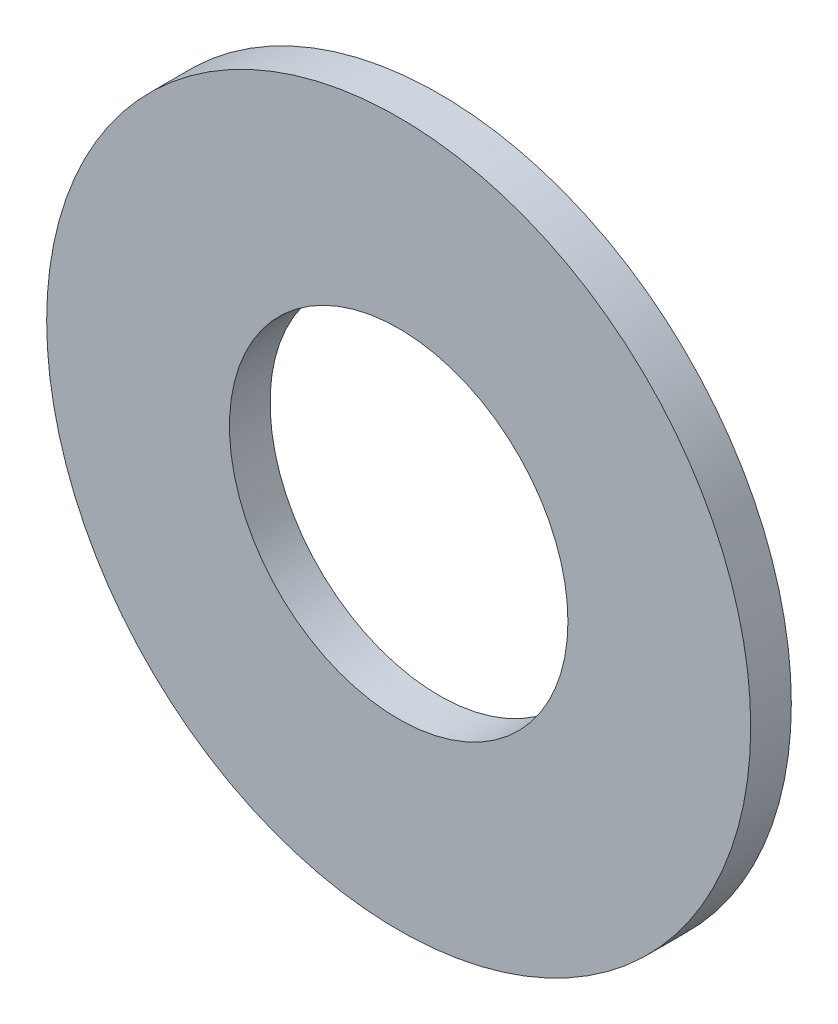
ISO-10303-21;
HEADER;
FILE_DESCRIPTION(('STEP AP214'),'2;1');
FILE_NAME('part.step','',(''),(''),'','','');
FILE_SCHEMA(('AUTOMOTIVE_DESIGN { 1 0 10303 214 1 1 1 1 }'));
ENDSEC;
DATA;
#1=APPLICATION_CONTEXT('core data for automotive mechanical design processes');
#2=APPLICATION_PROTOCOL_DEFINITION('international standard','automotive_design',2000,#1);
#3=PRODUCT_CONTEXT('',#1,'mechanical');
#4=PRODUCT('Part','Part','',(#3));
#5=PRODUCT_RELATED_PRODUCT_CATEGORY('part','',(#4));
#6=PRODUCT_DEFINITION_FORMATION('','',#4);
#7=PRODUCT_DEFINITION_CONTEXT('part definition',#1,'design');
#8=PRODUCT_DEFINITION('design','',#6,#7);
#9=PRODUCT_DEFINITION_SHAPE('','',#8);
#10=(LENGTH_UNIT() NAMED_UNIT(*) SI_UNIT(.MILLI.,.METRE.));
#11=(NAMED_UNIT(*) PLANE_ANGLE_UNIT() SI_UNIT($,.RADIAN.));
#12=(NAMED_UNIT(*) SI_UNIT($,.STERADIAN.) SOLID_ANGLE_UNIT());
#13=UNCERTAINTY_MEASURE_WITH_UNIT(LENGTH_MEASURE(1.E-05),#10,'distance_accuracy_value','');
#14=(GEOMETRIC_REPRESENTATION_CONTEXT(3) GLOBAL_UNCERTAINTY_ASSIGNED_CONTEXT((#13)) GLOBAL_UNIT_ASSIGNED_CONTEXT((#10,
#11,#12)) REPRESENTATION_CONTEXT('',''));
#15=CARTESIAN_POINT('',(0.,0.,0.));
#16=DIRECTION('',(0.,0.,1.));
#17=DIRECTION('',(1.,0.,0.));
#18=AXIS2_PLACEMENT_3D('',#15,#16,#17);
#19=CARTESIAN_POINT('',(0.,0.,3.));
#20=DIRECTION('',(0.,0.,1.));
#21=DIRECTION('',(1.,0.,0.));
#22=AXIS2_PLACEMENT_3D('',#19,#20,#21);
#23=PLANE('',#22);
#24=CARTESIAN_POINT('',(0.,0.,3.));
#25=DIRECTION('',(0.,0.,1.));
#26=DIRECTION('',(1.,0.,0.));
#27=AXIS2_PLACEMENT_3D('',#24,#25,#26);
#28=CIRCLE('',#27,26.);
#29=CARTESIAN_POINT('',(26.,0.,3.));
#30=VERTEX_POINT('',#29);
#31=EDGE_CURVE('E10',#30,#30,#28,.T.);
#32=ORIENTED_EDGE('',*,*,#31,.T.);
#33=EDGE_LOOP('',(#32));
#34=FACE_BOUND('',#33,.T.);
#35=CARTESIAN_POINT('',(0.,0.,3.));
#36=DIRECTION('',(0.,0.,1.));
#37=DIRECTION('',(1.,0.,0.));
#38=AXIS2_PLACEMENT_3D('',#35,#36,#37);
#39=CIRCLE('',#38,12.5);
#40=CARTESIAN_POINT('',(12.5,0.,3.));
#41=VERTEX_POINT('',#40);
#42=EDGE_CURVE('E41',#41,#41,#39,.T.);
#43=ORIENTED_EDGE('',*,*,#42,.F.);
#44=EDGE_LOOP('',(#43));
#45=FACE_BOUND('',#44,.T.);
#46=ADVANCED_FACE('F30',(#34,#45),#23,.T.);
#47=CARTESIAN_POINT('',(0.,0.,0.));
#48=DIRECTION('',(0.,0.,1.));
#49=DIRECTION('',(1.,0.,0.));
#50=AXIS2_PLACEMENT_3D('',#47,#48,#49);
#51=PLANE('',#50);
#52=CARTESIAN_POINT('',(0.,0.,0.));
#53=DIRECTION('',(0.,0.,1.));
#54=DIRECTION('',(1.,0.,0.));
#55=AXIS2_PLACEMENT_3D('',#52,#53,#54);
#56=CIRCLE('',#55,26.);
#57=CARTESIAN_POINT('',(26.,0.,0.));
#58=VERTEX_POINT('',#57);
#59=EDGE_CURVE('E34',#58,#58,#56,.T.);
#60=ORIENTED_EDGE('',*,*,#59,.F.);
#61=EDGE_LOOP('',(#60));
#62=FACE_BOUND('',#61,.T.);
#63=CARTESIAN_POINT('',(0.,0.,0.));
#64=DIRECTION('',(0.,0.,1.));
#65=DIRECTION('',(1.,0.,0.));
#66=AXIS2_PLACEMENT_3D('',#63,#64,#65);
#67=CIRCLE('',#66,12.5);
#68=CARTESIAN_POINT('',(12.5,0.,0.));
#69=VERTEX_POINT('',#68);
#70=EDGE_CURVE('E43',#69,#69,#67,.T.);
#71=ORIENTED_EDGE('',*,*,#70,.T.);
#72=EDGE_LOOP('',(#71));
#73=FACE_BOUND('',#72,.T.);
#74=ADVANCED_FACE('F53',(#62,#73),#51,.F.);
#75=CARTESIAN_POINT('',(0.,0.,3.));
#76=DIRECTION('',(0.,0.,-1.));
#77=DIRECTION('',(-1.,0.,0.));
#78=AXIS2_PLACEMENT_3D('',#75,#76,#77);
#79=CYLINDRICAL_SURFACE('',#78,26.);
#80=ORIENTED_EDGE('',*,*,#31,.F.);
#81=EDGE_LOOP('',(#80));
#82=FACE_BOUND('',#81,.T.);
#83=ORIENTED_EDGE('',*,*,#59,.T.);
#84=EDGE_LOOP('',(#83));
#85=FACE_BOUND('',#84,.T.);
#86=ADVANCED_FACE('F32',(#82,#85),#79,.T.);
#87=CARTESIAN_POINT('',(0.,0.,3.));
#88=DIRECTION('',(0.,0.,-1.));
#89=DIRECTION('',(-1.,0.,0.));
#90=AXIS2_PLACEMENT_3D('',#87,#88,#89);
#91=CYLINDRICAL_SURFACE('',#90,12.5);
#92=ORIENTED_EDGE('',*,*,#42,.T.);
#93=EDGE_LOOP('',(#92));
#94=FACE_BOUND('',#93,.T.);
#95=ORIENTED_EDGE('',*,*,#70,.F.);
#96=EDGE_LOOP('',(#95));
#97=FACE_BOUND('',#96,.T.);
#98=ADVANCED_FACE('F49',(#94,#97),#91,.F.);
#99=CLOSED_SHELL('',(#46,#74,#86,#98));
#100=MANIFOLD_SOLID_BREP('B2',#99);
#101=ADVANCED_BREP_SHAPE_REPRESENTATION('',(#18,#100),#14);
#102=SHAPE_DEFINITION_REPRESENTATION(#9,#101);
ENDSEC;
END-ISO-10303-21;
